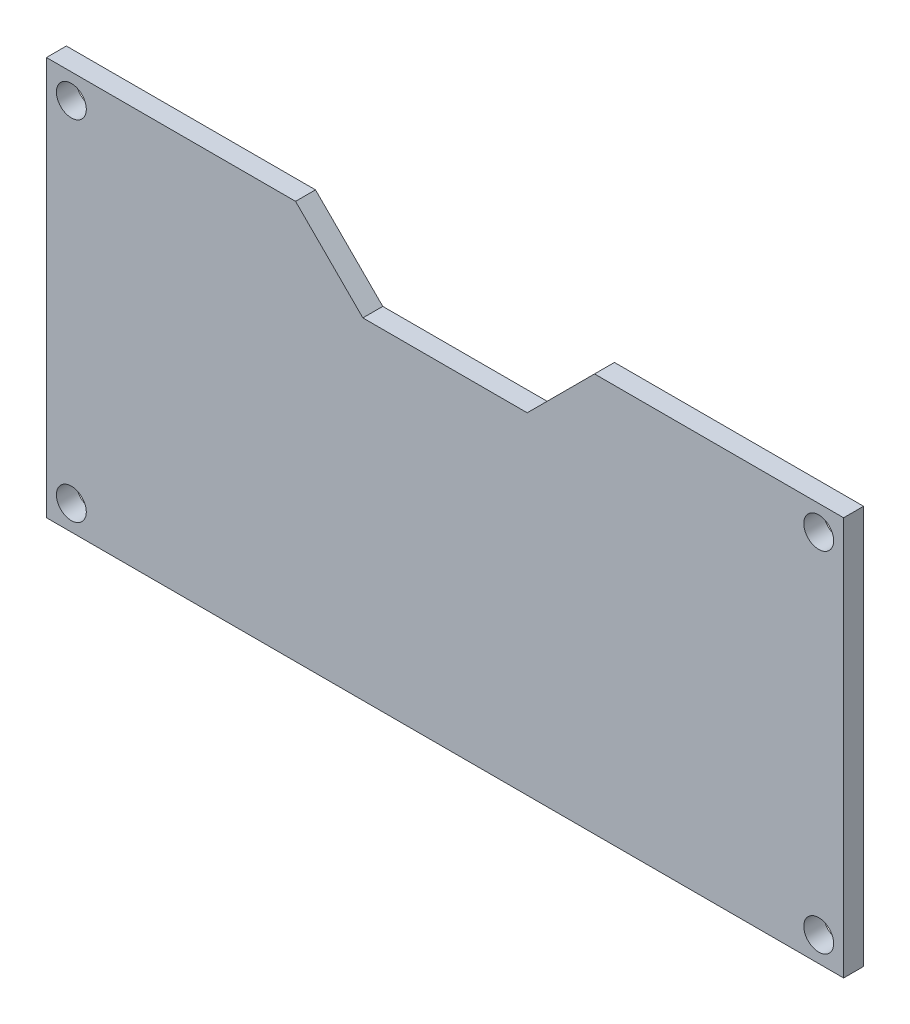
ISO-10303-21;
HEADER;
FILE_DESCRIPTION(('STEP AP214'),'2;1');
FILE_NAME('part.step','',(''),(''),'','','');
FILE_SCHEMA(('AUTOMOTIVE_DESIGN { 1 0 10303 214 1 1 1 1 }'));
ENDSEC;
DATA;
#1=APPLICATION_CONTEXT('core data for automotive mechanical design processes');
#2=APPLICATION_PROTOCOL_DEFINITION('international standard','automotive_design',2000,#1);
#3=PRODUCT_CONTEXT('',#1,'mechanical');
#4=PRODUCT('Part','Part','',(#3));
#5=PRODUCT_RELATED_PRODUCT_CATEGORY('part','',(#4));
#6=PRODUCT_DEFINITION_FORMATION('','',#4);
#7=PRODUCT_DEFINITION_CONTEXT('part definition',#1,'design');
#8=PRODUCT_DEFINITION('design','',#6,#7);
#9=PRODUCT_DEFINITION_SHAPE('','',#8);
#10=(LENGTH_UNIT() NAMED_UNIT(*) SI_UNIT(.MILLI.,.METRE.));
#11=(NAMED_UNIT(*) PLANE_ANGLE_UNIT() SI_UNIT($,.RADIAN.));
#12=(NAMED_UNIT(*) SI_UNIT($,.STERADIAN.) SOLID_ANGLE_UNIT());
#13=UNCERTAINTY_MEASURE_WITH_UNIT(LENGTH_MEASURE(1.E-05),#10,'distance_accuracy_value','');
#14=(GEOMETRIC_REPRESENTATION_CONTEXT(3) GLOBAL_UNCERTAINTY_ASSIGNED_CONTEXT((#13)) GLOBAL_UNIT_ASSIGNED_CONTEXT((#10,
#11,#12)) REPRESENTATION_CONTEXT('',''));
#15=CARTESIAN_POINT('',(0.,0.,0.));
#16=DIRECTION('',(0.,0.,1.));
#17=DIRECTION('',(1.,0.,0.));
#18=AXIS2_PLACEMENT_3D('',#15,#16,#17);
#19=CARTESIAN_POINT('',(0.,40.,2.));
#20=DIRECTION('',(0.,-1.,0.));
#21=DIRECTION('',(0.,0.,-1.));
#22=AXIS2_PLACEMENT_3D('',#19,#20,#21);
#23=PLANE('',#22);
#24=DIRECTION('',(-1.,0.,0.));
#25=VECTOR('',#24,1.);
#26=CARTESIAN_POINT('',(0.,40.,2.));
#27=LINE('',#26,#25);
#28=CARTESIAN_POINT('',(25.,40.,2.));
#29=VERTEX_POINT('',#28);
#30=CARTESIAN_POINT('',(0.,40.,2.));
#31=VERTEX_POINT('',#30);
#32=EDGE_CURVE('E63',#29,#31,#27,.T.);
#33=ORIENTED_EDGE('',*,*,#32,.F.);
#34=DIRECTION('',(0.,0.,-1.));
#35=VECTOR('',#34,1.);
#36=CARTESIAN_POINT('',(25.,40.,10.));
#37=LINE('',#36,#35);
#38=CARTESIAN_POINT('',(25.,40.,0.));
#39=VERTEX_POINT('',#38);
#40=EDGE_CURVE('E116',#29,#39,#37,.T.);
#41=ORIENTED_EDGE('',*,*,#40,.T.);
#42=DIRECTION('',(-1.,0.,0.));
#43=VECTOR('',#42,1.);
#44=CARTESIAN_POINT('',(0.,40.,0.));
#45=LINE('',#44,#43);
#46=CARTESIAN_POINT('',(0.,40.,0.));
#47=VERTEX_POINT('',#46);
#48=EDGE_CURVE('E85',#39,#47,#45,.T.);
#49=ORIENTED_EDGE('',*,*,#48,.T.);
#50=DIRECTION('',(0.,0.,-1.));
#51=VECTOR('',#50,1.);
#52=CARTESIAN_POINT('',(0.,40.,2.));
#53=LINE('',#52,#51);
#54=EDGE_CURVE('E145',#31,#47,#53,.T.);
#55=ORIENTED_EDGE('',*,*,#54,.F.);
#56=EDGE_LOOP('',(#33,#41,#49,#55));
#57=FACE_BOUND('',#56,.T.);
#58=ADVANCED_FACE('F38',(#57),#23,.F.);
#59=CARTESIAN_POINT('',(0.,0.,2.));
#60=DIRECTION('',(1.,0.,0.));
#61=DIRECTION('',(0.,0.,-1.));
#62=AXIS2_PLACEMENT_3D('',#59,#60,#61);
#63=PLANE('',#62);
#64=DIRECTION('',(0.,-1.,0.));
#65=VECTOR('',#64,1.);
#66=CARTESIAN_POINT('',(0.,0.,0.));
#67=LINE('',#66,#65);
#68=CARTESIAN_POINT('',(0.,0.,0.));
#69=VERTEX_POINT('',#68);
#70=EDGE_CURVE('E132',#47,#69,#67,.T.);
#71=ORIENTED_EDGE('',*,*,#70,.T.);
#72=DIRECTION('',(0.,0.,-1.));
#73=VECTOR('',#72,1.);
#74=CARTESIAN_POINT('',(0.,0.,2.));
#75=LINE('',#74,#73);
#76=CARTESIAN_POINT('',(0.,0.,2.));
#77=VERTEX_POINT('',#76);
#78=EDGE_CURVE('E11',#77,#69,#75,.T.);
#79=ORIENTED_EDGE('',*,*,#78,.F.);
#80=DIRECTION('',(0.,-1.,0.));
#81=VECTOR('',#80,1.);
#82=CARTESIAN_POINT('',(0.,0.,2.));
#83=LINE('',#82,#81);
#84=EDGE_CURVE('E140',#31,#77,#83,.T.);
#85=ORIENTED_EDGE('',*,*,#84,.F.);
#86=ORIENTED_EDGE('',*,*,#54,.T.);
#87=EDGE_LOOP('',(#71,#79,#85,#86));
#88=FACE_BOUND('',#87,.T.);
#89=ADVANCED_FACE('F40',(#88),#63,.F.);
#90=CARTESIAN_POINT('',(0.,0.,2.));
#91=DIRECTION('',(0.,1.,0.));
#92=DIRECTION('',(0.,0.,1.));
#93=AXIS2_PLACEMENT_3D('',#90,#91,#92);
#94=PLANE('',#93);
#95=DIRECTION('',(1.,0.,0.));
#96=VECTOR('',#95,1.);
#97=CARTESIAN_POINT('',(0.,0.,0.));
#98=LINE('',#97,#96);
#99=CARTESIAN_POINT('',(80.,0.,0.));
#100=VERTEX_POINT('',#99);
#101=EDGE_CURVE('E141',#69,#100,#98,.T.);
#102=ORIENTED_EDGE('',*,*,#101,.T.);
#103=DIRECTION('',(0.,0.,-1.));
#104=VECTOR('',#103,1.);
#105=CARTESIAN_POINT('',(80.,0.,2.));
#106=LINE('',#105,#104);
#107=CARTESIAN_POINT('',(80.,0.,2.));
#108=VERTEX_POINT('',#107);
#109=EDGE_CURVE('E47',#108,#100,#106,.T.);
#110=ORIENTED_EDGE('',*,*,#109,.F.);
#111=DIRECTION('',(1.,0.,0.));
#112=VECTOR('',#111,1.);
#113=CARTESIAN_POINT('',(0.,0.,2.));
#114=LINE('',#113,#112);
#115=EDGE_CURVE('E92',#77,#108,#114,.T.);
#116=ORIENTED_EDGE('',*,*,#115,.F.);
#117=ORIENTED_EDGE('',*,*,#78,.T.);
#118=EDGE_LOOP('',(#102,#110,#116,#117));
#119=FACE_BOUND('',#118,.T.);
#120=ADVANCED_FACE('F175',(#119),#94,.F.);
#121=CARTESIAN_POINT('',(80.,0.,2.));
#122=DIRECTION('',(-1.,0.,0.));
#123=DIRECTION('',(0.,0.,1.));
#124=AXIS2_PLACEMENT_3D('',#121,#122,#123);
#125=PLANE('',#124);
#126=DIRECTION('',(0.,1.,0.));
#127=VECTOR('',#126,1.);
#128=CARTESIAN_POINT('',(80.,0.,0.));
#129=LINE('',#128,#127);
#130=CARTESIAN_POINT('',(80.,40.,0.));
#131=VERTEX_POINT('',#130);
#132=EDGE_CURVE('E135',#100,#131,#129,.T.);
#133=ORIENTED_EDGE('',*,*,#132,.T.);
#134=DIRECTION('',(0.,0.,-1.));
#135=VECTOR('',#134,1.);
#136=CARTESIAN_POINT('',(80.,40.,2.));
#137=LINE('',#136,#135);
#138=CARTESIAN_POINT('',(80.,40.,2.));
#139=VERTEX_POINT('',#138);
#140=EDGE_CURVE('E148',#139,#131,#137,.T.);
#141=ORIENTED_EDGE('',*,*,#140,.F.);
#142=DIRECTION('',(0.,1.,0.));
#143=VECTOR('',#142,1.);
#144=CARTESIAN_POINT('',(80.,0.,2.));
#145=LINE('',#144,#143);
#146=EDGE_CURVE('E159',#108,#139,#145,.T.);
#147=ORIENTED_EDGE('',*,*,#146,.F.);
#148=ORIENTED_EDGE('',*,*,#109,.T.);
#149=EDGE_LOOP('',(#133,#141,#147,#148));
#150=FACE_BOUND('',#149,.T.);
#151=ADVANCED_FACE('F157',(#150),#125,.F.);
#152=CARTESIAN_POINT('',(55.,40.,0.));
#153=VERTEX_POINT('',#152);
#154=EDGE_CURVE('E134',#131,#153,#45,.T.);
#155=ORIENTED_EDGE('',*,*,#154,.T.);
#156=DIRECTION('',(0.,0.,-1.));
#157=VECTOR('',#156,1.);
#158=CARTESIAN_POINT('',(55.,40.,10.));
#159=LINE('',#158,#157);
#160=CARTESIAN_POINT('',(55.,40.,2.));
#161=VERTEX_POINT('',#160);
#162=EDGE_CURVE('E54',#161,#153,#159,.T.);
#163=ORIENTED_EDGE('',*,*,#162,.F.);
#164=EDGE_CURVE('E149',#139,#161,#27,.T.);
#165=ORIENTED_EDGE('',*,*,#164,.F.);
#166=ORIENTED_EDGE('',*,*,#140,.T.);
#167=EDGE_LOOP('',(#155,#163,#165,#166));
#168=FACE_BOUND('',#167,.T.);
#169=ADVANCED_FACE('F162',(#168),#23,.F.);
#170=CARTESIAN_POINT('',(0.,0.,2.));
#171=DIRECTION('',(0.,0.,-1.));
#172=DIRECTION('',(-1.,0.,0.));
#173=AXIS2_PLACEMENT_3D('',#170,#171,#172);
#174=PLANE('',#173);
#175=CARTESIAN_POINT('',(77.5,37.5,2.));
#176=DIRECTION('',(0.,0.,1.));
#177=DIRECTION('',(1.,0.,0.));
#178=AXIS2_PLACEMENT_3D('',#175,#176,#177);
#179=CIRCLE('',#178,1.5);
#180=CARTESIAN_POINT('',(79.,37.5,2.));
#181=VERTEX_POINT('',#180);
#182=EDGE_CURVE('E200',#181,#181,#179,.T.);
#183=ORIENTED_EDGE('',*,*,#182,.F.);
#184=EDGE_LOOP('',(#183));
#185=FACE_BOUND('',#184,.T.);
#186=CARTESIAN_POINT('',(2.5,2.5,2.));
#187=DIRECTION('',(0.,0.,1.));
#188=DIRECTION('',(1.,0.,0.));
#189=AXIS2_PLACEMENT_3D('',#186,#187,#188);
#190=CIRCLE('',#189,1.5);
#191=CARTESIAN_POINT('',(4.,2.5,2.));
#192=VERTEX_POINT('',#191);
#193=EDGE_CURVE('E191',#192,#192,#190,.T.);
#194=ORIENTED_EDGE('',*,*,#193,.F.);
#195=EDGE_LOOP('',(#194));
#196=FACE_BOUND('',#195,.T.);
#197=CARTESIAN_POINT('',(77.5,2.5,2.));
#198=DIRECTION('',(0.,0.,1.));
#199=DIRECTION('',(1.,0.,0.));
#200=AXIS2_PLACEMENT_3D('',#197,#198,#199);
#201=CIRCLE('',#200,1.5);
#202=CARTESIAN_POINT('',(79.,2.5,2.));
#203=VERTEX_POINT('',#202);
#204=EDGE_CURVE('E207',#203,#203,#201,.T.);
#205=ORIENTED_EDGE('',*,*,#204,.F.);
#206=EDGE_LOOP('',(#205));
#207=FACE_BOUND('',#206,.T.);
#208=CARTESIAN_POINT('',(2.5,37.5,2.));
#209=DIRECTION('',(0.,0.,1.));
#210=DIRECTION('',(1.,0.,0.));
#211=AXIS2_PLACEMENT_3D('',#208,#209,#210);
#212=CIRCLE('',#211,1.5);
#213=CARTESIAN_POINT('',(4.,37.5,2.));
#214=VERTEX_POINT('',#213);
#215=EDGE_CURVE('E183',#214,#214,#212,.T.);
#216=ORIENTED_EDGE('',*,*,#215,.F.);
#217=EDGE_LOOP('',(#216));
#218=FACE_BOUND('',#217,.T.);
#219=DIRECTION('',(-1.,0.,0.));
#220=VECTOR('',#219,1.);
#221=CARTESIAN_POINT('',(0.,33.2463085822754,2.));
#222=LINE('',#221,#220);
#223=CARTESIAN_POINT('',(48.2463085822753,33.2463085822754,2.));
#224=VERTEX_POINT('',#223);
#225=CARTESIAN_POINT('',(31.7536914177247,33.2463085822754,2.));
#226=VERTEX_POINT('',#225);
#227=EDGE_CURVE('E217',#224,#226,#222,.T.);
#228=ORIENTED_EDGE('',*,*,#227,.T.);
#229=DIRECTION('',(-0.707106781186551,0.707106781186544,0.));
#230=VECTOR('',#229,1.);
#231=CARTESIAN_POINT('',(32.4999999999999,32.5000000000002,2.));
#232=LINE('',#231,#230);
#233=EDGE_CURVE('E211',#226,#29,#232,.T.);
#234=ORIENTED_EDGE('',*,*,#233,.T.);
#235=ORIENTED_EDGE('',*,*,#32,.T.);
#236=ORIENTED_EDGE('',*,*,#84,.T.);
#237=ORIENTED_EDGE('',*,*,#115,.T.);
#238=ORIENTED_EDGE('',*,*,#146,.T.);
#239=ORIENTED_EDGE('',*,*,#164,.T.);
#240=DIRECTION('',(-0.707106781186551,-0.707106781186544,0.));
#241=VECTOR('',#240,1.);
#242=CARTESIAN_POINT('',(7.49999999999969,-7.49999999999977,2.));
#243=LINE('',#242,#241);
#244=EDGE_CURVE('E221',#161,#224,#243,.T.);
#245=ORIENTED_EDGE('',*,*,#244,.T.);
#246=EDGE_LOOP('',(#228,#234,#235,#236,#237,#238,#239,#245));
#247=FACE_BOUND('',#246,.T.);
#248=ADVANCED_FACE('F238',(#185,#196,#207,#218,#247),#174,.F.);
#249=CARTESIAN_POINT('',(0.,0.,0.));
#250=DIRECTION('',(0.,0.,-1.));
#251=DIRECTION('',(-1.,0.,0.));
#252=AXIS2_PLACEMENT_3D('',#249,#250,#251);
#253=PLANE('',#252);
#254=DIRECTION('',(-0.707106781186551,0.707106781186544,0.));
#255=VECTOR('',#254,1.);
#256=CARTESIAN_POINT('',(31.7536914177247,33.2463085822754,0.));
#257=LINE('',#256,#255);
#258=CARTESIAN_POINT('',(31.7536914177247,33.2463085822754,0.));
#259=VERTEX_POINT('',#258);
#260=EDGE_CURVE('E114',#259,#39,#257,.T.);
#261=ORIENTED_EDGE('',*,*,#260,.F.);
#262=DIRECTION('',(-1.,0.,0.));
#263=VECTOR('',#262,1.);
#264=CARTESIAN_POINT('',(48.2463085822753,33.2463085822754,0.));
#265=LINE('',#264,#263);
#266=CARTESIAN_POINT('',(48.2463085822753,33.2463085822754,0.));
#267=VERTEX_POINT('',#266);
#268=EDGE_CURVE('E126',#267,#259,#265,.T.);
#269=ORIENTED_EDGE('',*,*,#268,.F.);
#270=DIRECTION('',(-0.707106781186552,-0.707106781186544,0.));
#271=VECTOR('',#270,1.);
#272=CARTESIAN_POINT('',(55.,40.,0.));
#273=LINE('',#272,#271);
#274=EDGE_CURVE('E123',#153,#267,#273,.T.);
#275=ORIENTED_EDGE('',*,*,#274,.F.);
#276=ORIENTED_EDGE('',*,*,#154,.F.);
#277=ORIENTED_EDGE('',*,*,#132,.F.);
#278=ORIENTED_EDGE('',*,*,#101,.F.);
#279=ORIENTED_EDGE('',*,*,#70,.F.);
#280=ORIENTED_EDGE('',*,*,#48,.F.);
#281=EDGE_LOOP('',(#261,#269,#275,#276,#277,#278,#279,#280));
#282=FACE_BOUND('',#281,.T.);
#283=CARTESIAN_POINT('',(77.5,37.5,0.));
#284=DIRECTION('',(0.,0.,1.));
#285=DIRECTION('',(1.,0.,0.));
#286=AXIS2_PLACEMENT_3D('',#283,#284,#285);
#287=CIRCLE('',#286,1.5);
#288=CARTESIAN_POINT('',(79.,37.5,0.));
#289=VERTEX_POINT('',#288);
#290=EDGE_CURVE('E187',#289,#289,#287,.T.);
#291=ORIENTED_EDGE('',*,*,#290,.T.);
#292=EDGE_LOOP('',(#291));
#293=FACE_BOUND('',#292,.T.);
#294=CARTESIAN_POINT('',(2.5,2.5,0.));
#295=DIRECTION('',(0.,0.,1.));
#296=DIRECTION('',(1.,0.,0.));
#297=AXIS2_PLACEMENT_3D('',#294,#295,#296);
#298=CIRCLE('',#297,1.5);
#299=CARTESIAN_POINT('',(4.,2.5,0.));
#300=VERTEX_POINT('',#299);
#301=EDGE_CURVE('E195',#300,#300,#298,.T.);
#302=ORIENTED_EDGE('',*,*,#301,.T.);
#303=EDGE_LOOP('',(#302));
#304=FACE_BOUND('',#303,.T.);
#305=CARTESIAN_POINT('',(77.5,2.5,0.));
#306=DIRECTION('',(0.,0.,1.));
#307=DIRECTION('',(1.,0.,0.));
#308=AXIS2_PLACEMENT_3D('',#305,#306,#307);
#309=CIRCLE('',#308,1.5);
#310=CARTESIAN_POINT('',(79.,2.5,0.));
#311=VERTEX_POINT('',#310);
#312=EDGE_CURVE('E196',#311,#311,#309,.T.);
#313=ORIENTED_EDGE('',*,*,#312,.T.);
#314=EDGE_LOOP('',(#313));
#315=FACE_BOUND('',#314,.T.);
#316=CARTESIAN_POINT('',(2.5,37.5,0.));
#317=DIRECTION('',(0.,0.,1.));
#318=DIRECTION('',(1.,0.,0.));
#319=AXIS2_PLACEMENT_3D('',#316,#317,#318);
#320=CIRCLE('',#319,1.5);
#321=CARTESIAN_POINT('',(4.,37.5,0.));
#322=VERTEX_POINT('',#321);
#323=EDGE_CURVE('E173',#322,#322,#320,.T.);
#324=ORIENTED_EDGE('',*,*,#323,.T.);
#325=EDGE_LOOP('',(#324));
#326=FACE_BOUND('',#325,.T.);
#327=ADVANCED_FACE('F129',(#282,#293,#304,#315,#326),#253,.T.);
#328=CARTESIAN_POINT('',(2.5,37.5,0.));
#329=DIRECTION('',(0.,0.,1.));
#330=DIRECTION('',(1.,0.,0.));
#331=AXIS2_PLACEMENT_3D('',#328,#329,#330);
#332=CYLINDRICAL_SURFACE('',#331,1.5);
#333=ORIENTED_EDGE('',*,*,#323,.F.);
#334=EDGE_LOOP('',(#333));
#335=FACE_BOUND('',#334,.T.);
#336=ORIENTED_EDGE('',*,*,#215,.T.);
#337=EDGE_LOOP('',(#336));
#338=FACE_BOUND('',#337,.T.);
#339=ADVANCED_FACE('F246',(#335,#338),#332,.F.);
#340=CARTESIAN_POINT('',(77.5,2.5,0.));
#341=DIRECTION('',(0.,0.,1.));
#342=DIRECTION('',(1.,0.,0.));
#343=AXIS2_PLACEMENT_3D('',#340,#341,#342);
#344=CYLINDRICAL_SURFACE('',#343,1.5);
#345=ORIENTED_EDGE('',*,*,#312,.F.);
#346=EDGE_LOOP('',(#345));
#347=FACE_BOUND('',#346,.T.);
#348=ORIENTED_EDGE('',*,*,#204,.T.);
#349=EDGE_LOOP('',(#348));
#350=FACE_BOUND('',#349,.T.);
#351=ADVANCED_FACE('F292',(#347,#350),#344,.F.);
#352=CARTESIAN_POINT('',(2.5,2.5,0.));
#353=DIRECTION('',(0.,0.,1.));
#354=DIRECTION('',(1.,0.,0.));
#355=AXIS2_PLACEMENT_3D('',#352,#353,#354);
#356=CYLINDRICAL_SURFACE('',#355,1.5);
#357=ORIENTED_EDGE('',*,*,#301,.F.);
#358=EDGE_LOOP('',(#357));
#359=FACE_BOUND('',#358,.T.);
#360=ORIENTED_EDGE('',*,*,#193,.T.);
#361=EDGE_LOOP('',(#360));
#362=FACE_BOUND('',#361,.T.);
#363=ADVANCED_FACE('F298',(#359,#362),#356,.F.);
#364=CARTESIAN_POINT('',(77.5,37.5,0.));
#365=DIRECTION('',(0.,0.,1.));
#366=DIRECTION('',(1.,0.,0.));
#367=AXIS2_PLACEMENT_3D('',#364,#365,#366);
#368=CYLINDRICAL_SURFACE('',#367,1.5);
#369=ORIENTED_EDGE('',*,*,#290,.F.);
#370=EDGE_LOOP('',(#369));
#371=FACE_BOUND('',#370,.T.);
#372=ORIENTED_EDGE('',*,*,#182,.T.);
#373=EDGE_LOOP('',(#372));
#374=FACE_BOUND('',#373,.T.);
#375=ADVANCED_FACE('F306',(#371,#374),#368,.F.);
#376=CARTESIAN_POINT('',(31.7536914177247,33.2463085822754,10.));
#377=DIRECTION('',(-0.707106781186544,-0.707106781186551,0.));
#378=DIRECTION('',(0.707106781186551,-0.707106781186544,0.));
#379=AXIS2_PLACEMENT_3D('',#376,#377,#378);
#380=PLANE('',#379);
#381=DIRECTION('',(0.,0.,-1.));
#382=VECTOR('',#381,1.);
#383=CARTESIAN_POINT('',(31.7536914177247,33.2463085822754,10.));
#384=LINE('',#383,#382);
#385=EDGE_CURVE('E118',#226,#259,#384,.T.);
#386=ORIENTED_EDGE('',*,*,#385,.T.);
#387=ORIENTED_EDGE('',*,*,#260,.T.);
#388=ORIENTED_EDGE('',*,*,#40,.F.);
#389=ORIENTED_EDGE('',*,*,#233,.F.);
#390=EDGE_LOOP('',(#386,#387,#388,#389));
#391=FACE_BOUND('',#390,.T.);
#392=ADVANCED_FACE('F115',(#391),#380,.F.);
#393=CARTESIAN_POINT('',(48.2463085822753,33.2463085822754,10.));
#394=DIRECTION('',(0.,-1.,0.));
#395=DIRECTION('',(0.,0.,-1.));
#396=AXIS2_PLACEMENT_3D('',#393,#394,#395);
#397=PLANE('',#396);
#398=DIRECTION('',(0.,0.,-1.));
#399=VECTOR('',#398,1.);
#400=CARTESIAN_POINT('',(48.2463085822753,33.2463085822754,10.));
#401=LINE('',#400,#399);
#402=EDGE_CURVE('E226',#224,#267,#401,.T.);
#403=ORIENTED_EDGE('',*,*,#402,.T.);
#404=ORIENTED_EDGE('',*,*,#268,.T.);
#405=ORIENTED_EDGE('',*,*,#385,.F.);
#406=ORIENTED_EDGE('',*,*,#227,.F.);
#407=EDGE_LOOP('',(#403,#404,#405,#406));
#408=FACE_BOUND('',#407,.T.);
#409=ADVANCED_FACE('F237',(#408),#397,.F.);
#410=CARTESIAN_POINT('',(55.,40.,10.));
#411=DIRECTION('',(0.707106781186544,-0.707106781186552,0.));
#412=DIRECTION('',(0.707106781186551,0.707106781186544,0.));
#413=AXIS2_PLACEMENT_3D('',#410,#411,#412);
#414=PLANE('',#413);
#415=ORIENTED_EDGE('',*,*,#162,.T.);
#416=ORIENTED_EDGE('',*,*,#274,.T.);
#417=ORIENTED_EDGE('',*,*,#402,.F.);
#418=ORIENTED_EDGE('',*,*,#244,.F.);
#419=EDGE_LOOP('',(#415,#416,#417,#418));
#420=FACE_BOUND('',#419,.T.);
#421=ADVANCED_FACE('F235',(#420),#414,.F.);
#422=CLOSED_SHELL('',(#58,#89,#120,#151,#169,#248,#327,#339,#351,#363,#375,#392,#409,#421));
#423=MANIFOLD_SOLID_BREP('B2',#422);
#424=ADVANCED_BREP_SHAPE_REPRESENTATION('',(#18,#423),#14);
#425=SHAPE_DEFINITION_REPRESENTATION(#9,#424);
ENDSEC;
END-ISO-10303-21;
